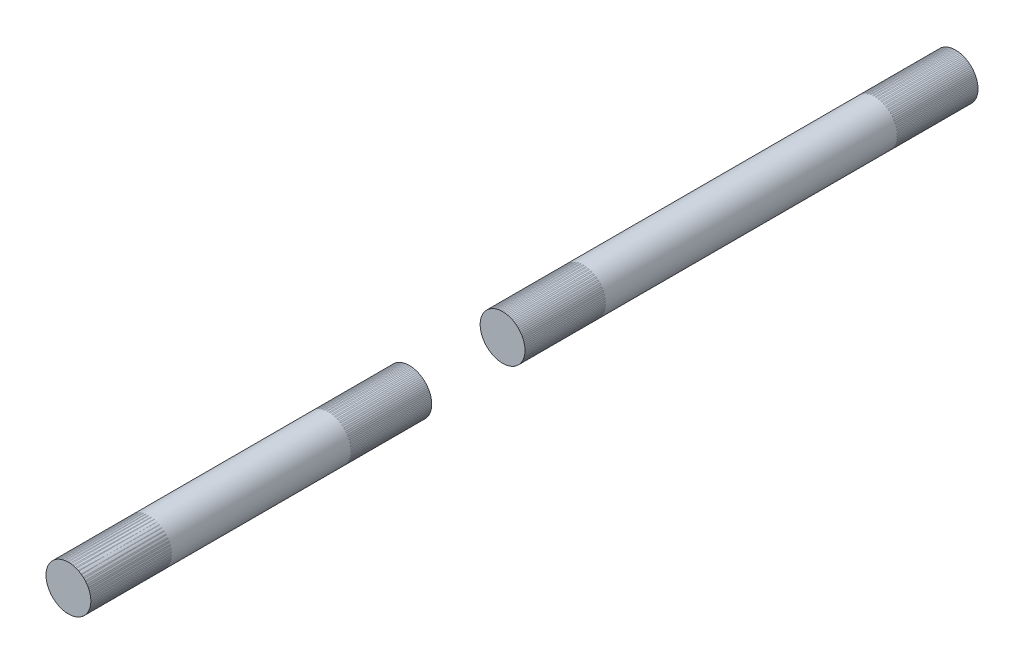
ISO-10303-21;
HEADER;
FILE_DESCRIPTION(('STEP AP214'),'2;1');
FILE_NAME('part.step','',(''),(''),'','','');
FILE_SCHEMA(('AUTOMOTIVE_DESIGN { 1 0 10303 214 1 1 1 1 }'));
ENDSEC;
DATA;
#1=APPLICATION_CONTEXT('core data for automotive mechanical design processes');
#2=APPLICATION_PROTOCOL_DEFINITION('international standard','automotive_design',2000,#1);
#3=PRODUCT_CONTEXT('',#1,'mechanical');
#4=PRODUCT('Part','Part','',(#3));
#5=PRODUCT_RELATED_PRODUCT_CATEGORY('part','',(#4));
#6=PRODUCT_DEFINITION_FORMATION('','',#4);
#7=PRODUCT_DEFINITION_CONTEXT('part definition',#1,'design');
#8=PRODUCT_DEFINITION('design','',#6,#7);
#9=PRODUCT_DEFINITION_SHAPE('','',#8);
#10=(LENGTH_UNIT() NAMED_UNIT(*) SI_UNIT(.MILLI.,.METRE.));
#11=(NAMED_UNIT(*) PLANE_ANGLE_UNIT() SI_UNIT($,.RADIAN.));
#12=(NAMED_UNIT(*) SI_UNIT($,.STERADIAN.) SOLID_ANGLE_UNIT());
#13=UNCERTAINTY_MEASURE_WITH_UNIT(LENGTH_MEASURE(1.E-05),#10,'distance_accuracy_value','');
#14=(GEOMETRIC_REPRESENTATION_CONTEXT(3) GLOBAL_UNCERTAINTY_ASSIGNED_CONTEXT((#13)) GLOBAL_UNIT_ASSIGNED_CONTEXT((#10,
#11,#12)) REPRESENTATION_CONTEXT('',''));
#15=CARTESIAN_POINT('',(0.,0.,0.));
#16=DIRECTION('',(0.,0.,1.));
#17=DIRECTION('',(1.,0.,0.));
#18=AXIS2_PLACEMENT_3D('',#15,#16,#17);
#19=CARTESIAN_POINT('',(0.,0.,-22.86));
#20=DIRECTION('',(0.,0.,-1.));
#21=DIRECTION('',(-1.,0.,0.));
#22=AXIS2_PLACEMENT_3D('',#19,#20,#21);
#23=PLANE('',#22);
#24=CARTESIAN_POINT('',(-1.33496743636763E-13,-1.0966338873124E-13,-22.86));
#25=DIRECTION('',(0.,0.,-1.));
#26=DIRECTION('',(-1.,0.,0.));
#27=AXIS2_PLACEMENT_3D('',#24,#25,#26);
#28=CIRCLE('',#27,6.35);
#29=CARTESIAN_POINT('',(-6.35000000000013,-1.0966338873124E-13,-22.86));
#30=VERTEX_POINT('',#29);
#31=EDGE_CURVE('E11',#30,#30,#28,.F.);
#32=ORIENTED_EDGE('',*,*,#31,.F.);
#33=EDGE_LOOP('',(#32));
#34=FACE_BOUND('',#33,.T.);
#35=ADVANCED_FACE('F41',(#34),#23,.T.);
#36=CARTESIAN_POINT('',(-1.33496743636763E-13,-1.0966338873124E-13,105.409999999999));
#37=DIRECTION('',(0.,0.,1.));
#38=DIRECTION('',(1.,0.,0.));
#39=AXIS2_PLACEMENT_3D('',#36,#37,#38);
#40=PLANE('',#39);
#41=CARTESIAN_POINT('',(-1.33496743636763E-13,-1.0966338873124E-13,105.409999999999));
#42=DIRECTION('',(0.,0.,1.));
#43=DIRECTION('',(1.,0.,0.));
#44=AXIS2_PLACEMENT_3D('',#41,#42,#43);
#45=CIRCLE('',#44,6.35);
#46=CARTESIAN_POINT('',(6.34999999999987,-1.0966338873124E-13,105.409999999999));
#47=VERTEX_POINT('',#46);
#48=EDGE_CURVE('E47',#47,#47,#45,.T.);
#49=ORIENTED_EDGE('',*,*,#48,.T.);
#50=EDGE_LOOP('',(#49));
#51=FACE_BOUND('',#50,.T.);
#52=ADVANCED_FACE('F53',(#51),#40,.T.);
#53=CARTESIAN_POINT('',(-1.33496743636763E-13,-1.0966338873124E-13,-40.8205122421383));
#54=DIRECTION('',(0.,0.,1.));
#55=DIRECTION('',(1.,0.,0.));
#56=AXIS2_PLACEMENT_3D('',#53,#54,#55);
#57=CYLINDRICAL_SURFACE('',#56,6.35);
#58=ORIENTED_EDGE('',*,*,#48,.F.);
#59=EDGE_LOOP('',(#58));
#60=FACE_BOUND('',#59,.T.);
#61=ORIENTED_EDGE('',*,*,#31,.T.);
#62=EDGE_LOOP('',(#61));
#63=FACE_BOUND('',#62,.T.);
#64=ADVANCED_FACE('F55',(#60,#63),#57,.T.);
#65=CLOSED_SHELL('',(#35,#52,#64));
#66=MANIFOLD_SOLID_BREP('B2',#65);
#67=CARTESIAN_POINT('',(2.48803304017915E-13,-1.15548843952093E-13,228.345999999999));
#68=DIRECTION('',(0.,0.,-1.));
#69=DIRECTION('',(-1.,0.,0.));
#70=AXIS2_PLACEMENT_3D('',#67,#68,#69);
#71=PLANE('',#70);
#72=CARTESIAN_POINT('',(2.48803304017915E-13,-1.15548843952093E-13,228.345999999999));
#73=DIRECTION('',(0.,0.,-1.));
#74=DIRECTION('',(-1.,0.,0.));
#75=AXIS2_PLACEMENT_3D('',#72,#73,#74);
#76=CIRCLE('',#75,6.35);
#77=CARTESIAN_POINT('',(-6.34999999999975,-1.15548843952093E-13,228.345999999999));
#78=VERTEX_POINT('',#77);
#79=EDGE_CURVE('E96',#78,#78,#76,.T.);
#80=ORIENTED_EDGE('',*,*,#79,.F.);
#81=EDGE_LOOP('',(#80));
#82=FACE_BOUND('',#81,.T.);
#83=ADVANCED_FACE('F89',(#82),#71,.F.);
#84=CARTESIAN_POINT('',(2.48803304017915E-13,-1.15548843952093E-13,113.865487757861));
#85=DIRECTION('',(0.,0.,1.));
#86=DIRECTION('',(1.,0.,0.));
#87=AXIS2_PLACEMENT_3D('',#84,#85,#86);
#88=CYLINDRICAL_SURFACE('',#87,6.35);
#89=CARTESIAN_POINT('',(2.48803304017915E-13,-1.15548843952093E-13,131.825999999999));
#90=DIRECTION('',(0.,0.,1.));
#91=DIRECTION('',(1.,0.,0.));
#92=AXIS2_PLACEMENT_3D('',#89,#90,#91);
#93=CIRCLE('',#92,6.35);
#94=CARTESIAN_POINT('',(6.35000000000025,-1.15548843952093E-13,131.825999999999));
#95=VERTEX_POINT('',#94);
#96=EDGE_CURVE('E40',#95,#95,#93,.T.);
#97=ORIENTED_EDGE('',*,*,#96,.T.);
#98=EDGE_LOOP('',(#97));
#99=FACE_BOUND('',#98,.T.);
#100=ORIENTED_EDGE('',*,*,#79,.T.);
#101=EDGE_LOOP('',(#100));
#102=FACE_BOUND('',#101,.T.);
#103=ADVANCED_FACE('F91',(#99,#102),#88,.T.);
#104=CARTESIAN_POINT('',(0.,0.,131.825999999999));
#105=DIRECTION('',(0.,0.,1.));
#106=DIRECTION('',(1.,0.,0.));
#107=AXIS2_PLACEMENT_3D('',#104,#105,#106);
#108=PLANE('',#107);
#109=ORIENTED_EDGE('',*,*,#96,.F.);
#110=EDGE_LOOP('',(#109));
#111=FACE_BOUND('',#110,.T.);
#112=ADVANCED_FACE('F107',(#111),#108,.F.);
#113=CLOSED_SHELL('',(#83,#103,#112));
#114=MANIFOLD_SOLID_BREP('B6',#113);
#115=CARTESIAN_POINT('',(0.,0.,216.915999999999));
#116=DIRECTION('',(0.,0.,1.));
#117=DIRECTION('',(-0.482671383681736,0.875801538805886,0.));
#118=AXIS2_PLACEMENT_3D('',#115,#116,#117);
#119=CYLINDRICAL_SURFACE('',#118,6.35);
#120=CARTESIAN_POINT('',(0.,0.,205.485999999999));
#121=DIRECTION('',(0.,0.,1.));
#122=DIRECTION('',(-0.482671383681736,0.875801538805886,0.));
#123=AXIS2_PLACEMENT_3D('',#120,#121,#122);
#124=CIRCLE('',#123,6.35);
#125=CARTESIAN_POINT('',(-3.06496328637909,5.56133977141745,205.485999999999));
#126=VERTEX_POINT('',#125);
#127=EDGE_CURVE('E141',#126,#126,#124,.T.);
#128=ORIENTED_EDGE('',*,*,#127,.F.);
#129=EDGE_LOOP('',(#128));
#130=FACE_BOUND('',#129,.T.);
#131=CARTESIAN_POINT('',(0.,0.,228.345999999999));
#132=DIRECTION('',(0.,0.,1.));
#133=DIRECTION('',(-0.482671383681736,0.875801538805886,0.));
#134=AXIS2_PLACEMENT_3D('',#131,#132,#133);
#135=CIRCLE('',#134,6.35);
#136=CARTESIAN_POINT('',(-3.0649632863791,5.56133977141745,228.345999999999));
#137=VERTEX_POINT('',#136);
#138=EDGE_CURVE('E88',#137,#137,#135,.F.);
#139=ORIENTED_EDGE('',*,*,#138,.F.);
#140=EDGE_LOOP('',(#139));
#141=FACE_BOUND('',#140,.T.);
#142=ADVANCED_FACE('F137',(#130,#141),#119,.F.);
#143=OPEN_SHELL('',(#142));
#144=SHELL_BASED_SURFACE_MODEL('B35',(#143));
#145=CARTESIAN_POINT('',(0.,0.,93.9799999999993));
#146=DIRECTION('',(0.,0.,1.));
#147=DIRECTION('',(-0.482671383681736,0.875801538805887,0.));
#148=AXIS2_PLACEMENT_3D('',#145,#146,#147);
#149=CYLINDRICAL_SURFACE('',#148,6.35);
#150=CARTESIAN_POINT('',(0.,0.,82.5499999999993));
#151=DIRECTION('',(0.,0.,1.));
#152=DIRECTION('',(-0.482671383681736,0.875801538805887,0.));
#153=AXIS2_PLACEMENT_3D('',#150,#151,#152);
#154=CIRCLE('',#153,6.35);
#155=CARTESIAN_POINT('',(-3.06496328637907,5.56133977141738,82.5499999999993));
#156=VERTEX_POINT('',#155);
#157=EDGE_CURVE('E136',#156,#156,#154,.T.);
#158=ORIENTED_EDGE('',*,*,#157,.F.);
#159=EDGE_LOOP('',(#158));
#160=FACE_BOUND('',#159,.T.);
#161=CARTESIAN_POINT('',(0.,0.,105.409999999999));
#162=DIRECTION('',(0.,0.,1.));
#163=DIRECTION('',(-0.482671383681736,0.875801538805887,0.));
#164=AXIS2_PLACEMENT_3D('',#161,#162,#163);
#165=CIRCLE('',#164,6.35);
#166=CARTESIAN_POINT('',(-3.06496328637907,5.56133977141738,105.409999999999));
#167=VERTEX_POINT('',#166);
#168=EDGE_CURVE('E173',#167,#167,#165,.F.);
#169=ORIENTED_EDGE('',*,*,#168,.F.);
#170=EDGE_LOOP('',(#169));
#171=FACE_BOUND('',#170,.T.);
#172=ADVANCED_FACE('F169',(#160,#171),#149,.F.);
#173=OPEN_SHELL('',(#172));
#174=SHELL_BASED_SURFACE_MODEL('B83',(#173));
#175=CARTESIAN_POINT('',(0.,0.,143.255999999999));
#176=DIRECTION('',(0.,0.,-1.));
#177=DIRECTION('',(0.482671383681736,-0.875801538805887,0.));
#178=AXIS2_PLACEMENT_3D('',#175,#176,#177);
#179=CYLINDRICAL_SURFACE('',#178,6.35);
#180=CARTESIAN_POINT('',(0.,0.,154.685999999999));
#181=DIRECTION('',(0.,0.,-1.));
#182=DIRECTION('',(0.482671383681736,-0.875801538805887,0.));
#183=AXIS2_PLACEMENT_3D('',#180,#181,#182);
#184=CIRCLE('',#183,6.35);
#185=CARTESIAN_POINT('',(3.06496328637897,-5.56133977141738,154.685999999999));
#186=VERTEX_POINT('',#185);
#187=EDGE_CURVE('E204',#186,#186,#184,.T.);
#188=ORIENTED_EDGE('',*,*,#187,.F.);
#189=EDGE_LOOP('',(#188));
#190=FACE_BOUND('',#189,.T.);
#191=CARTESIAN_POINT('',(0.,0.,131.825999999999));
#192=DIRECTION('',(0.,0.,-1.));
#193=DIRECTION('',(0.482671383681736,-0.875801538805887,0.));
#194=AXIS2_PLACEMENT_3D('',#191,#192,#193);
#195=CIRCLE('',#194,6.35);
#196=CARTESIAN_POINT('',(3.06496328637897,-5.56133977141738,131.825999999999));
#197=VERTEX_POINT('',#196);
#198=EDGE_CURVE('E168',#197,#197,#195,.F.);
#199=ORIENTED_EDGE('',*,*,#198,.F.);
#200=EDGE_LOOP('',(#199));
#201=FACE_BOUND('',#200,.T.);
#202=ADVANCED_FACE('F200',(#190,#201),#179,.F.);
#203=OPEN_SHELL('',(#202));
#204=SHELL_BASED_SURFACE_MODEL('B131',(#203));
#205=CARTESIAN_POINT('',(0.,0.,-11.43));
#206=DIRECTION('',(0.,0.,-1.));
#207=DIRECTION('',(-1.,0.,0.));
#208=AXIS2_PLACEMENT_3D('',#205,#206,#207);
#209=CYLINDRICAL_SURFACE('',#208,6.35);
#210=CARTESIAN_POINT('',(0.,0.,-22.86));
#211=DIRECTION('',(0.,0.,-1.));
#212=DIRECTION('',(-1.,0.,0.));
#213=AXIS2_PLACEMENT_3D('',#210,#211,#212);
#214=CIRCLE('',#213,6.35);
#215=CARTESIAN_POINT('',(-6.35000000000003,0.,-22.86));
#216=VERTEX_POINT('',#215);
#217=EDGE_CURVE('E228',#216,#216,#214,.F.);
#218=ORIENTED_EDGE('',*,*,#217,.F.);
#219=EDGE_LOOP('',(#218));
#220=FACE_BOUND('',#219,.T.);
#221=CARTESIAN_POINT('',(0.,0.,0.));
#222=DIRECTION('',(0.,0.,-1.));
#223=DIRECTION('',(-1.,0.,0.));
#224=AXIS2_PLACEMENT_3D('',#221,#222,#223);
#225=CIRCLE('',#224,6.35);
#226=CARTESIAN_POINT('',(-6.35000000000004,0.,0.));
#227=VERTEX_POINT('',#226);
#228=EDGE_CURVE('E199',#227,#227,#225,.T.);
#229=ORIENTED_EDGE('',*,*,#228,.F.);
#230=EDGE_LOOP('',(#229));
#231=FACE_BOUND('',#230,.T.);
#232=ADVANCED_FACE('F224',(#220,#231),#209,.F.);
#233=OPEN_SHELL('',(#232));
#234=SHELL_BASED_SURFACE_MODEL('B163',(#233));
#235=ADVANCED_BREP_SHAPE_REPRESENTATION('',(#18,#66,#114),#14);
#236=MANIFOLD_SURFACE_SHAPE_REPRESENTATION('',(#18,#144,#174,#204,#234),#14);
#237=SHAPE_REPRESENTATION('',(#18),#14);
#238=SHAPE_DEFINITION_REPRESENTATION(#9,#237);
#239=SHAPE_REPRESENTATION_RELATIONSHIP('','',#237,#235);
#240=SHAPE_REPRESENTATION_RELATIONSHIP('','',#237,#236);
ENDSEC;
END-ISO-10303-21;
